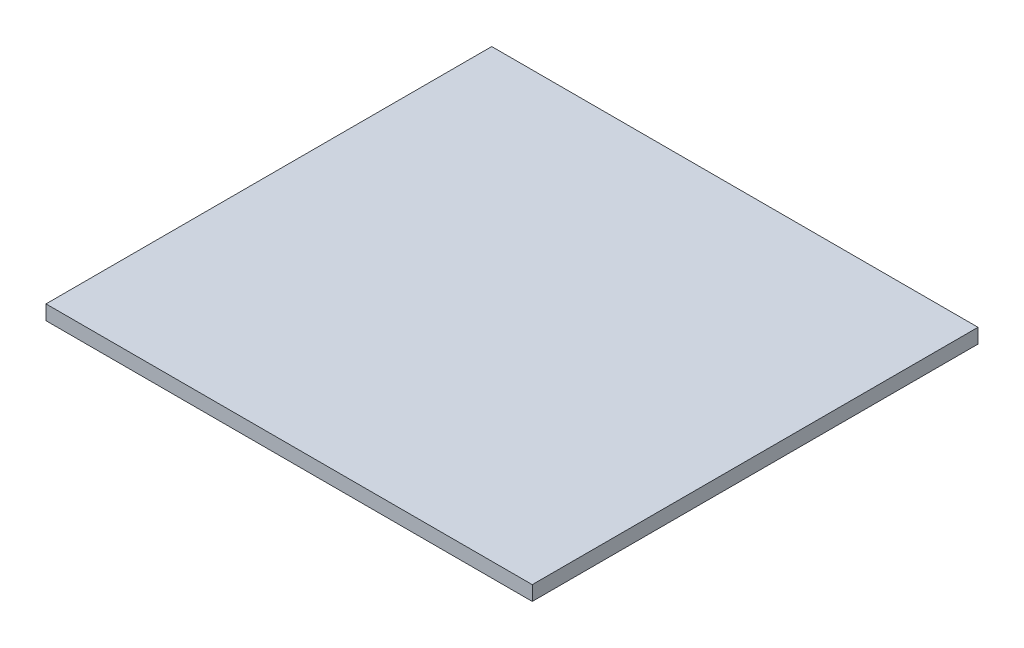
ISO-10303-21;
HEADER;
FILE_DESCRIPTION(('STEP AP214'),'2;1');
FILE_NAME('part.step','',(''),(''),'','','');
FILE_SCHEMA(('AUTOMOTIVE_DESIGN { 1 0 10303 214 1 1 1 1 }'));
ENDSEC;
DATA;
#1=APPLICATION_CONTEXT('core data for automotive mechanical design processes');
#2=APPLICATION_PROTOCOL_DEFINITION('international standard','automotive_design',2000,#1);
#3=PRODUCT_CONTEXT('',#1,'mechanical');
#4=PRODUCT('Part','Part','',(#3));
#5=PRODUCT_RELATED_PRODUCT_CATEGORY('part','',(#4));
#6=PRODUCT_DEFINITION_FORMATION('','',#4);
#7=PRODUCT_DEFINITION_CONTEXT('part definition',#1,'design');
#8=PRODUCT_DEFINITION('design','',#6,#7);
#9=PRODUCT_DEFINITION_SHAPE('','',#8);
#10=(LENGTH_UNIT() NAMED_UNIT(*) SI_UNIT(.MILLI.,.METRE.));
#11=(NAMED_UNIT(*) PLANE_ANGLE_UNIT() SI_UNIT($,.RADIAN.));
#12=(NAMED_UNIT(*) SI_UNIT($,.STERADIAN.) SOLID_ANGLE_UNIT());
#13=UNCERTAINTY_MEASURE_WITH_UNIT(LENGTH_MEASURE(1.E-05),#10,'distance_accuracy_value','');
#14=(GEOMETRIC_REPRESENTATION_CONTEXT(3) GLOBAL_UNCERTAINTY_ASSIGNED_CONTEXT((#13)) GLOBAL_UNIT_ASSIGNED_CONTEXT((#10,
#11,#12)) REPRESENTATION_CONTEXT('',''));
#15=CARTESIAN_POINT('',(0.,0.,0.));
#16=DIRECTION('',(0.,0.,1.));
#17=DIRECTION('',(1.,0.,0.));
#18=AXIS2_PLACEMENT_3D('',#15,#16,#17);
#19=CARTESIAN_POINT('',(-300.,18.,275.));
#20=DIRECTION('',(1.,0.,0.));
#21=DIRECTION('',(0.,0.,-1.));
#22=AXIS2_PLACEMENT_3D('',#19,#20,#21);
#23=PLANE('',#22);
#24=DIRECTION('',(0.,0.,1.));
#25=VECTOR('',#24,1.);
#26=CARTESIAN_POINT('',(-300.,0.,275.));
#27=LINE('',#26,#25);
#28=CARTESIAN_POINT('',(-300.,0.,-275.));
#29=VERTEX_POINT('',#28);
#30=CARTESIAN_POINT('',(-300.,0.,275.));
#31=VERTEX_POINT('',#30);
#32=EDGE_CURVE('E98',#29,#31,#27,.T.);
#33=ORIENTED_EDGE('',*,*,#32,.T.);
#34=DIRECTION('',(0.,-1.,0.));
#35=VECTOR('',#34,1.);
#36=CARTESIAN_POINT('',(-300.,18.,275.));
#37=LINE('',#36,#35);
#38=CARTESIAN_POINT('',(-300.,18.,275.));
#39=VERTEX_POINT('',#38);
#40=EDGE_CURVE('E11',#39,#31,#37,.T.);
#41=ORIENTED_EDGE('',*,*,#40,.F.);
#42=DIRECTION('',(0.,0.,1.));
#43=VECTOR('',#42,1.);
#44=CARTESIAN_POINT('',(-300.,18.,275.));
#45=LINE('',#44,#43);
#46=CARTESIAN_POINT('',(-300.,18.,-275.));
#47=VERTEX_POINT('',#46);
#48=EDGE_CURVE('E86',#47,#39,#45,.T.);
#49=ORIENTED_EDGE('',*,*,#48,.F.);
#50=DIRECTION('',(0.,-1.,0.));
#51=VECTOR('',#50,1.);
#52=CARTESIAN_POINT('',(-300.,18.,-275.));
#53=LINE('',#52,#51);
#54=EDGE_CURVE('E94',#47,#29,#53,.T.);
#55=ORIENTED_EDGE('',*,*,#54,.T.);
#56=EDGE_LOOP('',(#33,#41,#49,#55));
#57=FACE_BOUND('',#56,.T.);
#58=ADVANCED_FACE('F35',(#57),#23,.F.);
#59=CARTESIAN_POINT('',(300.,18.,275.));
#60=DIRECTION('',(0.,0.,-1.));
#61=DIRECTION('',(-1.,0.,0.));
#62=AXIS2_PLACEMENT_3D('',#59,#60,#61);
#63=PLANE('',#62);
#64=DIRECTION('',(1.,0.,0.));
#65=VECTOR('',#64,1.);
#66=CARTESIAN_POINT('',(300.,0.,275.));
#67=LINE('',#66,#65);
#68=CARTESIAN_POINT('',(300.,0.,275.));
#69=VERTEX_POINT('',#68);
#70=EDGE_CURVE('E90',#31,#69,#67,.T.);
#71=ORIENTED_EDGE('',*,*,#70,.T.);
#72=DIRECTION('',(0.,-1.,0.));
#73=VECTOR('',#72,1.);
#74=CARTESIAN_POINT('',(300.,18.,275.));
#75=LINE('',#74,#73);
#76=CARTESIAN_POINT('',(300.,18.,275.));
#77=VERTEX_POINT('',#76);
#78=EDGE_CURVE('E43',#77,#69,#75,.T.);
#79=ORIENTED_EDGE('',*,*,#78,.F.);
#80=DIRECTION('',(1.,0.,0.));
#81=VECTOR('',#80,1.);
#82=CARTESIAN_POINT('',(300.,18.,275.));
#83=LINE('',#82,#81);
#84=EDGE_CURVE('E81',#39,#77,#83,.T.);
#85=ORIENTED_EDGE('',*,*,#84,.F.);
#86=ORIENTED_EDGE('',*,*,#40,.T.);
#87=EDGE_LOOP('',(#71,#79,#85,#86));
#88=FACE_BOUND('',#87,.T.);
#89=ADVANCED_FACE('F89',(#88),#63,.F.);
#90=CARTESIAN_POINT('',(300.,18.,275.));
#91=DIRECTION('',(-1.,0.,0.));
#92=DIRECTION('',(0.,0.,1.));
#93=AXIS2_PLACEMENT_3D('',#90,#91,#92);
#94=PLANE('',#93);
#95=DIRECTION('',(0.,0.,-1.));
#96=VECTOR('',#95,1.);
#97=CARTESIAN_POINT('',(300.,0.,275.));
#98=LINE('',#97,#96);
#99=CARTESIAN_POINT('',(300.,0.,-275.));
#100=VERTEX_POINT('',#99);
#101=EDGE_CURVE('E68',#69,#100,#98,.T.);
#102=ORIENTED_EDGE('',*,*,#101,.T.);
#103=DIRECTION('',(0.,-1.,0.));
#104=VECTOR('',#103,1.);
#105=CARTESIAN_POINT('',(300.,18.,-275.));
#106=LINE('',#105,#104);
#107=CARTESIAN_POINT('',(300.,18.,-275.));
#108=VERTEX_POINT('',#107);
#109=EDGE_CURVE('E91',#108,#100,#106,.T.);
#110=ORIENTED_EDGE('',*,*,#109,.F.);
#111=DIRECTION('',(0.,0.,-1.));
#112=VECTOR('',#111,1.);
#113=CARTESIAN_POINT('',(300.,18.,275.));
#114=LINE('',#113,#112);
#115=EDGE_CURVE('E84',#77,#108,#114,.T.);
#116=ORIENTED_EDGE('',*,*,#115,.F.);
#117=ORIENTED_EDGE('',*,*,#78,.T.);
#118=EDGE_LOOP('',(#102,#110,#116,#117));
#119=FACE_BOUND('',#118,.T.);
#120=ADVANCED_FACE('F92',(#119),#94,.F.);
#121=CARTESIAN_POINT('',(300.,18.,-275.));
#122=DIRECTION('',(0.,0.,1.));
#123=DIRECTION('',(1.,0.,0.));
#124=AXIS2_PLACEMENT_3D('',#121,#122,#123);
#125=PLANE('',#124);
#126=DIRECTION('',(-1.,0.,0.));
#127=VECTOR('',#126,1.);
#128=CARTESIAN_POINT('',(300.,0.,-275.));
#129=LINE('',#128,#127);
#130=EDGE_CURVE('E74',#100,#29,#129,.T.);
#131=ORIENTED_EDGE('',*,*,#130,.T.);
#132=ORIENTED_EDGE('',*,*,#54,.F.);
#133=DIRECTION('',(-1.,0.,0.));
#134=VECTOR('',#133,1.);
#135=CARTESIAN_POINT('',(300.,18.,-275.));
#136=LINE('',#135,#134);
#137=EDGE_CURVE('E51',#108,#47,#136,.T.);
#138=ORIENTED_EDGE('',*,*,#137,.F.);
#139=ORIENTED_EDGE('',*,*,#109,.T.);
#140=EDGE_LOOP('',(#131,#132,#138,#139));
#141=FACE_BOUND('',#140,.T.);
#142=ADVANCED_FACE('F105',(#141),#125,.F.);
#143=CARTESIAN_POINT('',(0.,18.,0.));
#144=DIRECTION('',(0.,1.,0.));
#145=DIRECTION('',(0.,0.,1.));
#146=AXIS2_PLACEMENT_3D('',#143,#144,#145);
#147=PLANE('',#146);
#148=ORIENTED_EDGE('',*,*,#48,.T.);
#149=ORIENTED_EDGE('',*,*,#84,.T.);
#150=ORIENTED_EDGE('',*,*,#115,.T.);
#151=ORIENTED_EDGE('',*,*,#137,.T.);
#152=EDGE_LOOP('',(#148,#149,#150,#151));
#153=FACE_BOUND('',#152,.T.);
#154=ADVANCED_FACE('F82',(#153),#147,.T.);
#155=CARTESIAN_POINT('',(0.,0.,0.));
#156=DIRECTION('',(0.,1.,0.));
#157=DIRECTION('',(0.,0.,1.));
#158=AXIS2_PLACEMENT_3D('',#155,#156,#157);
#159=PLANE('',#158);
#160=ORIENTED_EDGE('',*,*,#32,.F.);
#161=ORIENTED_EDGE('',*,*,#130,.F.);
#162=ORIENTED_EDGE('',*,*,#101,.F.);
#163=ORIENTED_EDGE('',*,*,#70,.F.);
#164=EDGE_LOOP('',(#160,#161,#162,#163));
#165=FACE_BOUND('',#164,.T.);
#166=ADVANCED_FACE('F108',(#165),#159,.F.);
#167=CLOSED_SHELL('',(#58,#89,#120,#142,#154,#166));
#168=MANIFOLD_SOLID_BREP('B2',#167);
#169=ADVANCED_BREP_SHAPE_REPRESENTATION('',(#18,#168),#14);
#170=SHAPE_DEFINITION_REPRESENTATION(#9,#169);
ENDSEC;
END-ISO-10303-21;
